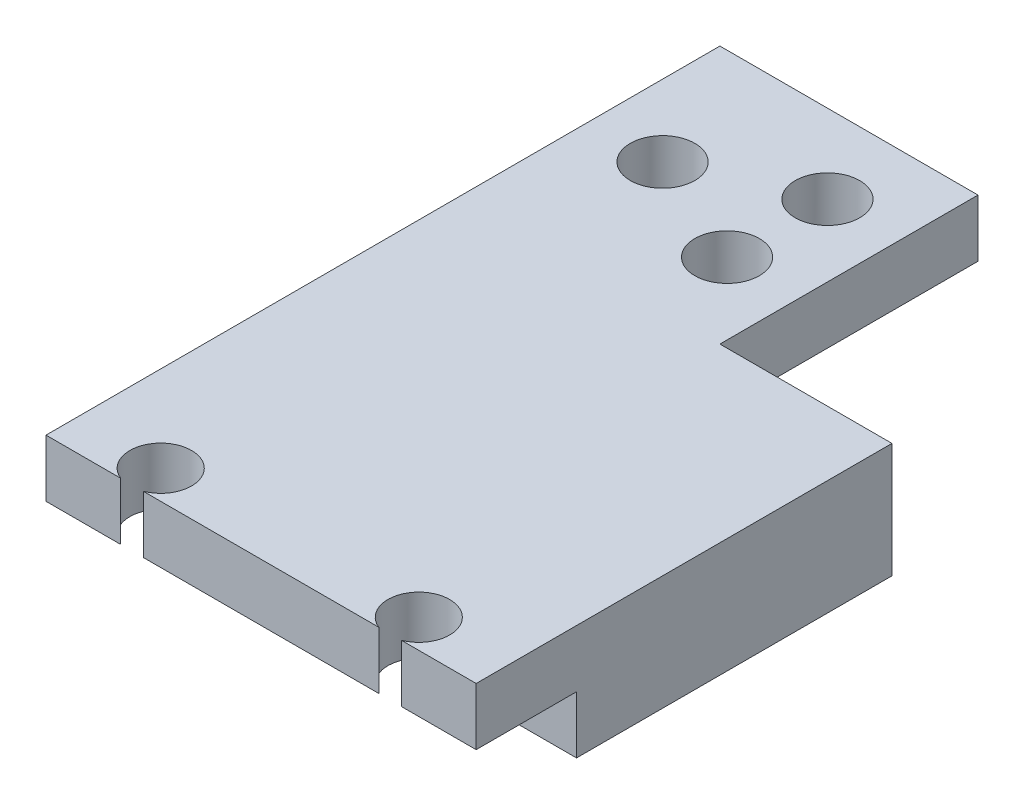
ISO-10303-21;
HEADER;
FILE_DESCRIPTION(('STEP AP214'),'2;1');
FILE_NAME('part.step','',(''),(''),'','','');
FILE_SCHEMA(('AUTOMOTIVE_DESIGN { 1 0 10303 214 1 1 1 1 }'));
ENDSEC;
DATA;
#1=APPLICATION_CONTEXT('core data for automotive mechanical design processes');
#2=APPLICATION_PROTOCOL_DEFINITION('international standard','automotive_design',2000,#1);
#3=PRODUCT_CONTEXT('',#1,'mechanical');
#4=PRODUCT('Part','Part','',(#3));
#5=PRODUCT_RELATED_PRODUCT_CATEGORY('part','',(#4));
#6=PRODUCT_DEFINITION_FORMATION('','',#4);
#7=PRODUCT_DEFINITION_CONTEXT('part definition',#1,'design');
#8=PRODUCT_DEFINITION('design','',#6,#7);
#9=PRODUCT_DEFINITION_SHAPE('','',#8);
#10=(LENGTH_UNIT() NAMED_UNIT(*) SI_UNIT(.MILLI.,.METRE.));
#11=(NAMED_UNIT(*) PLANE_ANGLE_UNIT() SI_UNIT($,.RADIAN.));
#12=(NAMED_UNIT(*) SI_UNIT($,.STERADIAN.) SOLID_ANGLE_UNIT());
#13=UNCERTAINTY_MEASURE_WITH_UNIT(LENGTH_MEASURE(1.E-05),#10,'distance_accuracy_value','');
#14=(GEOMETRIC_REPRESENTATION_CONTEXT(3) GLOBAL_UNCERTAINTY_ASSIGNED_CONTEXT((#13)) GLOBAL_UNIT_ASSIGNED_CONTEXT((#10,
#11,#12)) REPRESENTATION_CONTEXT('',''));
#15=CARTESIAN_POINT('',(0.,0.,0.));
#16=DIRECTION('',(0.,0.,1.));
#17=DIRECTION('',(1.,0.,0.));
#18=AXIS2_PLACEMENT_3D('',#15,#16,#17);
#19=CARTESIAN_POINT('',(15.,4.,14.5));
#20=DIRECTION('',(-1.,0.,0.));
#21=DIRECTION('',(0.,0.,1.));
#22=AXIS2_PLACEMENT_3D('',#19,#20,#21);
#23=PLANE('',#22);
#24=DIRECTION('',(0.,-1.,0.));
#25=VECTOR('',#24,1.);
#26=CARTESIAN_POINT('',(15.,4.,-14.5));
#27=LINE('',#26,#25);
#28=CARTESIAN_POINT('',(15.,4.,-14.5));
#29=VERTEX_POINT('',#28);
#30=CARTESIAN_POINT('',(15.,-4.,-14.5));
#31=VERTEX_POINT('',#30);
#32=EDGE_CURVE('E11',#29,#31,#27,.T.);
#33=ORIENTED_EDGE('',*,*,#32,.F.);
#34=DIRECTION('',(0.,0.,-1.));
#35=VECTOR('',#34,1.);
#36=CARTESIAN_POINT('',(15.,4.,14.5));
#37=LINE('',#36,#35);
#38=CARTESIAN_POINT('',(15.,4.,14.5));
#39=VERTEX_POINT('',#38);
#40=EDGE_CURVE('E178',#39,#29,#37,.T.);
#41=ORIENTED_EDGE('',*,*,#40,.F.);
#42=DIRECTION('',(0.,-1.,0.));
#43=VECTOR('',#42,1.);
#44=CARTESIAN_POINT('',(15.,4.,14.5));
#45=LINE('',#44,#43);
#46=CARTESIAN_POINT('',(15.,0.,14.5));
#47=VERTEX_POINT('',#46);
#48=EDGE_CURVE('E193',#39,#47,#45,.T.);
#49=ORIENTED_EDGE('',*,*,#48,.T.);
#50=DIRECTION('',(0.,0.,-1.));
#51=VECTOR('',#50,1.);
#52=CARTESIAN_POINT('',(15.,0.,14.5));
#53=LINE('',#52,#51);
#54=CARTESIAN_POINT('',(15.,0.,7.5));
#55=VERTEX_POINT('',#54);
#56=EDGE_CURVE('E177',#47,#55,#53,.T.);
#57=ORIENTED_EDGE('',*,*,#56,.T.);
#58=DIRECTION('',(0.,1.,0.));
#59=VECTOR('',#58,1.);
#60=CARTESIAN_POINT('',(15.,-4.,7.5));
#61=LINE('',#60,#59);
#62=CARTESIAN_POINT('',(15.,-4.,7.5));
#63=VERTEX_POINT('',#62);
#64=EDGE_CURVE('E174',#63,#55,#61,.T.);
#65=ORIENTED_EDGE('',*,*,#64,.F.);
#66=DIRECTION('',(0.,0.,1.));
#67=VECTOR('',#66,1.);
#68=CARTESIAN_POINT('',(15.,-4.,-14.5));
#69=LINE('',#68,#67);
#70=EDGE_CURVE('E159',#31,#63,#69,.T.);
#71=ORIENTED_EDGE('',*,*,#70,.F.);
#72=EDGE_LOOP('',(#33,#41,#49,#57,#65,#71));
#73=FACE_BOUND('',#72,.T.);
#74=ADVANCED_FACE('F33',(#73),#23,.F.);
#75=CARTESIAN_POINT('',(-9.,4.,12.5));
#76=DIRECTION('',(0.,1.,0.));
#77=DIRECTION('',(0.,0.,1.));
#78=AXIS2_PLACEMENT_3D('',#75,#76,#77);
#79=PLANE('',#78);
#80=CARTESIAN_POINT('',(-10.,4.,-23.5));
#81=DIRECTION('',(0.,1.,0.));
#82=DIRECTION('',(0.,0.,1.));
#83=AXIS2_PLACEMENT_3D('',#80,#81,#82);
#84=CIRCLE('',#83,2.25000000000001);
#85=CARTESIAN_POINT('',(-10.,4.,-21.25));
#86=VERTEX_POINT('',#85);
#87=EDGE_CURVE('E426',#86,#86,#84,.T.);
#88=ORIENTED_EDGE('',*,*,#87,.F.);
#89=EDGE_LOOP('',(#88));
#90=FACE_BOUND('',#89,.T.);
#91=CARTESIAN_POINT('',(-2.,4.,-20.));
#92=DIRECTION('',(0.,1.,0.));
#93=DIRECTION('',(0.,0.,1.));
#94=AXIS2_PLACEMENT_3D('',#91,#92,#93);
#95=CIRCLE('',#94,2.25);
#96=CARTESIAN_POINT('',(-2.,4.,-17.75));
#97=VERTEX_POINT('',#96);
#98=EDGE_CURVE('E436',#97,#97,#95,.T.);
#99=ORIENTED_EDGE('',*,*,#98,.F.);
#100=EDGE_LOOP('',(#99));
#101=FACE_BOUND('',#100,.T.);
#102=CARTESIAN_POINT('',(-2.,4.,-27.));
#103=DIRECTION('',(0.,1.,0.));
#104=DIRECTION('',(0.,0.,1.));
#105=AXIS2_PLACEMENT_3D('',#102,#103,#104);
#106=CIRCLE('',#105,2.25);
#107=CARTESIAN_POINT('',(-2.,4.,-24.75));
#108=VERTEX_POINT('',#107);
#109=EDGE_CURVE('E156',#108,#108,#106,.T.);
#110=ORIENTED_EDGE('',*,*,#109,.F.);
#111=EDGE_LOOP('',(#110));
#112=FACE_BOUND('',#111,.T.);
#113=DIRECTION('',(1.,0.,0.));
#114=VECTOR('',#113,1.);
#115=CARTESIAN_POINT('',(3.,4.,-14.5));
#116=LINE('',#115,#114);
#117=CARTESIAN_POINT('',(3.,4.,-14.5));
#118=VERTEX_POINT('',#117);
#119=EDGE_CURVE('E142',#118,#29,#116,.T.);
#120=ORIENTED_EDGE('',*,*,#119,.F.);
#121=DIRECTION('',(0.,0.,1.));
#122=VECTOR('',#121,1.);
#123=CARTESIAN_POINT('',(3.,4.,-32.5));
#124=LINE('',#123,#122);
#125=CARTESIAN_POINT('',(3.,4.,-32.5));
#126=VERTEX_POINT('',#125);
#127=EDGE_CURVE('E128',#126,#118,#124,.T.);
#128=ORIENTED_EDGE('',*,*,#127,.F.);
#129=DIRECTION('',(1.,0.,0.));
#130=VECTOR('',#129,1.);
#131=CARTESIAN_POINT('',(-15.,4.,-32.5));
#132=LINE('',#131,#130);
#133=CARTESIAN_POINT('',(-15.,4.,-32.5));
#134=VERTEX_POINT('',#133);
#135=EDGE_CURVE('E138',#134,#126,#132,.T.);
#136=ORIENTED_EDGE('',*,*,#135,.F.);
#137=DIRECTION('',(0.,0.,1.));
#138=VECTOR('',#137,1.);
#139=CARTESIAN_POINT('',(-15.,4.,14.5));
#140=LINE('',#139,#138);
#141=CARTESIAN_POINT('',(-15.,4.,14.5));
#142=VERTEX_POINT('',#141);
#143=EDGE_CURVE('E180',#134,#142,#140,.T.);
#144=ORIENTED_EDGE('',*,*,#143,.T.);
#145=DIRECTION('',(1.,0.,0.));
#146=VECTOR('',#145,1.);
#147=CARTESIAN_POINT('',(-15.,4.,14.5));
#148=LINE('',#147,#146);
#149=CARTESIAN_POINT('',(-9.78898669190298,4.,14.5));
#150=VERTEX_POINT('',#149);
#151=EDGE_CURVE('E183',#142,#150,#148,.T.);
#152=ORIENTED_EDGE('',*,*,#151,.T.);
#153=CARTESIAN_POINT('',(-9.,4.,12.5));
#154=DIRECTION('',(0.,-1.,0.));
#155=DIRECTION('',(0.,0.,1.));
#156=AXIS2_PLACEMENT_3D('',#153,#154,#155);
#157=CIRCLE('',#156,2.15);
#158=CARTESIAN_POINT('',(-8.21101330809702,4.,14.5));
#159=VERTEX_POINT('',#158);
#160=EDGE_CURVE('E185',#150,#159,#157,.T.);
#161=ORIENTED_EDGE('',*,*,#160,.T.);
#162=DIRECTION('',(1.,0.,0.));
#163=VECTOR('',#162,1.);
#164=CARTESIAN_POINT('',(-8.21101330809702,4.,14.5));
#165=LINE('',#164,#163);
#166=CARTESIAN_POINT('',(8.21101330809702,4.,14.5));
#167=VERTEX_POINT('',#166);
#168=EDGE_CURVE('E187',#159,#167,#165,.T.);
#169=ORIENTED_EDGE('',*,*,#168,.T.);
#170=CARTESIAN_POINT('',(9.,4.,12.5));
#171=DIRECTION('',(0.,-1.,0.));
#172=DIRECTION('',(0.,0.,-1.));
#173=AXIS2_PLACEMENT_3D('',#170,#171,#172);
#174=CIRCLE('',#173,2.15);
#175=CARTESIAN_POINT('',(9.78898669190297,4.,14.5));
#176=VERTEX_POINT('',#175);
#177=EDGE_CURVE('E189',#167,#176,#174,.T.);
#178=ORIENTED_EDGE('',*,*,#177,.T.);
#179=DIRECTION('',(1.,0.,0.));
#180=VECTOR('',#179,1.);
#181=CARTESIAN_POINT('',(9.78898669190298,4.,14.5));
#182=LINE('',#181,#180);
#183=EDGE_CURVE('E191',#176,#39,#182,.T.);
#184=ORIENTED_EDGE('',*,*,#183,.T.);
#185=ORIENTED_EDGE('',*,*,#40,.T.);
#186=EDGE_LOOP('',(#120,#128,#136,#144,#152,#161,#169,#178,#184,#185));
#187=FACE_BOUND('',#186,.T.);
#188=ADVANCED_FACE('F137',(#90,#101,#112,#187),#79,.T.);
#189=CARTESIAN_POINT('',(-15.,0.,-32.5));
#190=DIRECTION('',(0.,1.,0.));
#191=DIRECTION('',(-1.,0.,0.));
#192=AXIS2_PLACEMENT_3D('',#189,#190,#191);
#193=PLANE('',#192);
#194=CARTESIAN_POINT('',(-2.,0.,-27.));
#195=DIRECTION('',(0.,1.,0.));
#196=DIRECTION('',(-1.,0.,0.));
#197=AXIS2_PLACEMENT_3D('',#194,#195,#196);
#198=CIRCLE('',#197,2.25);
#199=CARTESIAN_POINT('',(-4.25,0.,-27.));
#200=VERTEX_POINT('',#199);
#201=EDGE_CURVE('E439',#200,#200,#198,.T.);
#202=ORIENTED_EDGE('',*,*,#201,.T.);
#203=EDGE_LOOP('',(#202));
#204=FACE_BOUND('',#203,.T.);
#205=CARTESIAN_POINT('',(-2.,0.,-20.));
#206=DIRECTION('',(0.,1.,0.));
#207=DIRECTION('',(1.,0.,0.));
#208=AXIS2_PLACEMENT_3D('',#205,#206,#207);
#209=CIRCLE('',#208,2.25);
#210=CARTESIAN_POINT('',(0.249999999999999,0.,-20.));
#211=VERTEX_POINT('',#210);
#212=EDGE_CURVE('E432',#211,#211,#209,.T.);
#213=ORIENTED_EDGE('',*,*,#212,.T.);
#214=EDGE_LOOP('',(#213));
#215=FACE_BOUND('',#214,.T.);
#216=CARTESIAN_POINT('',(-10.,0.,-23.5));
#217=DIRECTION('',(0.,1.,0.));
#218=DIRECTION('',(-1.,0.,0.));
#219=AXIS2_PLACEMENT_3D('',#216,#217,#218);
#220=CIRCLE('',#219,2.25000000000001);
#221=CARTESIAN_POINT('',(-12.25,0.,-23.5));
#222=VERTEX_POINT('',#221);
#223=EDGE_CURVE('E429',#222,#222,#220,.T.);
#224=ORIENTED_EDGE('',*,*,#223,.T.);
#225=EDGE_LOOP('',(#224));
#226=FACE_BOUND('',#225,.T.);
#227=DIRECTION('',(0.,0.,1.));
#228=VECTOR('',#227,1.);
#229=CARTESIAN_POINT('',(3.,0.,-32.5));
#230=LINE('',#229,#228);
#231=CARTESIAN_POINT('',(3.,0.,-32.5));
#232=VERTEX_POINT('',#231);
#233=CARTESIAN_POINT('',(3.,0.,-14.5));
#234=VERTEX_POINT('',#233);
#235=EDGE_CURVE('E47',#232,#234,#230,.T.);
#236=ORIENTED_EDGE('',*,*,#235,.T.);
#237=DIRECTION('',(-1.,0.,0.));
#238=VECTOR('',#237,1.);
#239=CARTESIAN_POINT('',(-15.,0.,-14.5));
#240=LINE('',#239,#238);
#241=CARTESIAN_POINT('',(-15.,0.,-14.5));
#242=VERTEX_POINT('',#241);
#243=EDGE_CURVE('E151',#234,#242,#240,.T.);
#244=ORIENTED_EDGE('',*,*,#243,.T.);
#245=DIRECTION('',(0.,0.,1.));
#246=VECTOR('',#245,1.);
#247=CARTESIAN_POINT('',(-15.,0.,-32.5));
#248=LINE('',#247,#246);
#249=CARTESIAN_POINT('',(-15.,0.,-32.5));
#250=VERTEX_POINT('',#249);
#251=EDGE_CURVE('E149',#250,#242,#248,.T.);
#252=ORIENTED_EDGE('',*,*,#251,.F.);
#253=DIRECTION('',(-1.,0.,0.));
#254=VECTOR('',#253,1.);
#255=CARTESIAN_POINT('',(-15.,0.,-32.5));
#256=LINE('',#255,#254);
#257=EDGE_CURVE('E147',#232,#250,#256,.T.);
#258=ORIENTED_EDGE('',*,*,#257,.F.);
#259=EDGE_LOOP('',(#236,#244,#252,#258));
#260=FACE_BOUND('',#259,.T.);
#261=ADVANCED_FACE('F280',(#204,#215,#226,#260),#193,.F.);
#262=CARTESIAN_POINT('',(0.,0.,-32.5));
#263=DIRECTION('',(0.,0.,-1.));
#264=DIRECTION('',(-1.,0.,0.));
#265=AXIS2_PLACEMENT_3D('',#262,#263,#264);
#266=PLANE('',#265);
#267=ORIENTED_EDGE('',*,*,#135,.T.);
#268=DIRECTION('',(0.,-1.,0.));
#269=VECTOR('',#268,1.);
#270=CARTESIAN_POINT('',(3.,4.001,-32.5));
#271=LINE('',#270,#269);
#272=EDGE_CURVE('E125',#126,#232,#271,.T.);
#273=ORIENTED_EDGE('',*,*,#272,.T.);
#274=ORIENTED_EDGE('',*,*,#257,.T.);
#275=DIRECTION('',(0.,1.,0.));
#276=VECTOR('',#275,1.);
#277=CARTESIAN_POINT('',(-15.,0.,-32.5));
#278=LINE('',#277,#276);
#279=EDGE_CURVE('E146',#250,#134,#278,.T.);
#280=ORIENTED_EDGE('',*,*,#279,.T.);
#281=EDGE_LOOP('',(#267,#273,#274,#280));
#282=FACE_BOUND('',#281,.T.);
#283=ADVANCED_FACE('F144',(#282),#266,.T.);
#284=CARTESIAN_POINT('',(-15.,4.,-14.5));
#285=DIRECTION('',(0.,0.,1.));
#286=DIRECTION('',(1.,0.,0.));
#287=AXIS2_PLACEMENT_3D('',#284,#285,#286);
#288=PLANE('',#287);
#289=ORIENTED_EDGE('',*,*,#243,.F.);
#290=DIRECTION('',(0.,-1.,0.));
#291=VECTOR('',#290,1.);
#292=CARTESIAN_POINT('',(3.,4.001,-14.5));
#293=LINE('',#292,#291);
#294=EDGE_CURVE('E133',#118,#234,#293,.T.);
#295=ORIENTED_EDGE('',*,*,#294,.F.);
#296=ORIENTED_EDGE('',*,*,#119,.T.);
#297=ORIENTED_EDGE('',*,*,#32,.T.);
#298=DIRECTION('',(1.,0.,0.));
#299=VECTOR('',#298,1.);
#300=CARTESIAN_POINT('',(15.,-4.,-14.5));
#301=LINE('',#300,#299);
#302=CARTESIAN_POINT('',(-15.,-4.,-14.5));
#303=VERTEX_POINT('',#302);
#304=EDGE_CURVE('E167',#303,#31,#301,.T.);
#305=ORIENTED_EDGE('',*,*,#304,.F.);
#306=DIRECTION('',(0.,-1.,0.));
#307=VECTOR('',#306,1.);
#308=CARTESIAN_POINT('',(-15.,4.,-14.5));
#309=LINE('',#308,#307);
#310=EDGE_CURVE('E40',#242,#303,#309,.T.);
#311=ORIENTED_EDGE('',*,*,#310,.F.);
#312=EDGE_LOOP('',(#289,#295,#296,#297,#305,#311));
#313=FACE_BOUND('',#312,.T.);
#314=ADVANCED_FACE('F234',(#313),#288,.F.);
#315=CARTESIAN_POINT('',(-9.,0.,12.5));
#316=DIRECTION('',(0.,1.,0.));
#317=DIRECTION('',(0.,0.,1.));
#318=AXIS2_PLACEMENT_3D('',#315,#316,#317);
#319=PLANE('',#318);
#320=DIRECTION('',(-1.,0.,0.));
#321=VECTOR('',#320,1.);
#322=CARTESIAN_POINT('',(15.,0.,7.5));
#323=LINE('',#322,#321);
#324=CARTESIAN_POINT('',(-15.,0.,7.5));
#325=VERTEX_POINT('',#324);
#326=EDGE_CURVE('E55',#55,#325,#323,.T.);
#327=ORIENTED_EDGE('',*,*,#326,.F.);
#328=ORIENTED_EDGE('',*,*,#56,.F.);
#329=DIRECTION('',(1.,0.,0.));
#330=VECTOR('',#329,1.);
#331=CARTESIAN_POINT('',(9.78898669190298,0.,14.5));
#332=LINE('',#331,#330);
#333=CARTESIAN_POINT('',(9.78898669190297,0.,14.5));
#334=VERTEX_POINT('',#333);
#335=EDGE_CURVE('E181',#334,#47,#332,.T.);
#336=ORIENTED_EDGE('',*,*,#335,.F.);
#337=CARTESIAN_POINT('',(9.,0.,12.5));
#338=DIRECTION('',(0.,-1.,0.));
#339=DIRECTION('',(0.,0.,-1.));
#340=AXIS2_PLACEMENT_3D('',#337,#338,#339);
#341=CIRCLE('',#340,2.15);
#342=CARTESIAN_POINT('',(8.21101330809702,0.,14.5));
#343=VERTEX_POINT('',#342);
#344=EDGE_CURVE('E203',#343,#334,#341,.T.);
#345=ORIENTED_EDGE('',*,*,#344,.F.);
#346=DIRECTION('',(1.,0.,0.));
#347=VECTOR('',#346,1.);
#348=CARTESIAN_POINT('',(-8.21101330809702,0.,14.5));
#349=LINE('',#348,#347);
#350=CARTESIAN_POINT('',(-8.21101330809702,0.,14.5));
#351=VERTEX_POINT('',#350);
#352=EDGE_CURVE('E201',#351,#343,#349,.T.);
#353=ORIENTED_EDGE('',*,*,#352,.F.);
#354=CARTESIAN_POINT('',(-9.,0.,12.5));
#355=DIRECTION('',(0.,-1.,0.));
#356=DIRECTION('',(0.,0.,1.));
#357=AXIS2_PLACEMENT_3D('',#354,#355,#356);
#358=CIRCLE('',#357,2.15);
#359=CARTESIAN_POINT('',(-9.78898669190298,0.,14.5));
#360=VERTEX_POINT('',#359);
#361=EDGE_CURVE('E199',#360,#351,#358,.T.);
#362=ORIENTED_EDGE('',*,*,#361,.F.);
#363=DIRECTION('',(1.,0.,0.));
#364=VECTOR('',#363,1.);
#365=CARTESIAN_POINT('',(-15.,0.,14.5));
#366=LINE('',#365,#364);
#367=CARTESIAN_POINT('',(-15.,0.,14.5));
#368=VERTEX_POINT('',#367);
#369=EDGE_CURVE('E197',#368,#360,#366,.T.);
#370=ORIENTED_EDGE('',*,*,#369,.F.);
#371=DIRECTION('',(0.,0.,1.));
#372=VECTOR('',#371,1.);
#373=CARTESIAN_POINT('',(-15.,0.,14.5));
#374=LINE('',#373,#372);
#375=EDGE_CURVE('E195',#325,#368,#374,.T.);
#376=ORIENTED_EDGE('',*,*,#375,.F.);
#377=EDGE_LOOP('',(#327,#328,#336,#345,#353,#362,#370,#376));
#378=FACE_BOUND('',#377,.T.);
#379=ADVANCED_FACE('F247',(#378),#319,.F.);
#380=CARTESIAN_POINT('',(-15.,4.,14.5));
#381=DIRECTION('',(1.,0.,0.));
#382=DIRECTION('',(0.,0.,-1.));
#383=AXIS2_PLACEMENT_3D('',#380,#381,#382);
#384=PLANE('',#383);
#385=ORIENTED_EDGE('',*,*,#143,.F.);
#386=ORIENTED_EDGE('',*,*,#279,.F.);
#387=ORIENTED_EDGE('',*,*,#251,.T.);
#388=ORIENTED_EDGE('',*,*,#310,.T.);
#389=DIRECTION('',(0.,0.,-1.));
#390=VECTOR('',#389,1.);
#391=CARTESIAN_POINT('',(-15.,-4.,-14.5));
#392=LINE('',#391,#390);
#393=CARTESIAN_POINT('',(-15.,-4.,7.5));
#394=VERTEX_POINT('',#393);
#395=EDGE_CURVE('E164',#394,#303,#392,.T.);
#396=ORIENTED_EDGE('',*,*,#395,.F.);
#397=DIRECTION('',(0.,1.,0.));
#398=VECTOR('',#397,1.);
#399=CARTESIAN_POINT('',(-15.,-4.,7.5));
#400=LINE('',#399,#398);
#401=EDGE_CURVE('E170',#394,#325,#400,.T.);
#402=ORIENTED_EDGE('',*,*,#401,.T.);
#403=ORIENTED_EDGE('',*,*,#375,.T.);
#404=DIRECTION('',(0.,-1.,0.));
#405=VECTOR('',#404,1.);
#406=CARTESIAN_POINT('',(-15.,4.,14.5));
#407=LINE('',#406,#405);
#408=EDGE_CURVE('E220',#142,#368,#407,.T.);
#409=ORIENTED_EDGE('',*,*,#408,.F.);
#410=EDGE_LOOP('',(#385,#386,#387,#388,#396,#402,#403,#409));
#411=FACE_BOUND('',#410,.T.);
#412=ADVANCED_FACE('F225',(#411),#384,.F.);
#413=CARTESIAN_POINT('',(-15.,4.,14.5));
#414=DIRECTION('',(0.,0.,-1.));
#415=DIRECTION('',(-1.,0.,0.));
#416=AXIS2_PLACEMENT_3D('',#413,#414,#415);
#417=PLANE('',#416);
#418=ORIENTED_EDGE('',*,*,#369,.T.);
#419=DIRECTION('',(0.,-1.,0.));
#420=VECTOR('',#419,1.);
#421=CARTESIAN_POINT('',(-9.78898669190298,4.,14.5));
#422=LINE('',#421,#420);
#423=EDGE_CURVE('E217',#150,#360,#422,.T.);
#424=ORIENTED_EDGE('',*,*,#423,.F.);
#425=ORIENTED_EDGE('',*,*,#151,.F.);
#426=ORIENTED_EDGE('',*,*,#408,.T.);
#427=EDGE_LOOP('',(#418,#424,#425,#426));
#428=FACE_BOUND('',#427,.T.);
#429=ADVANCED_FACE('F244',(#428),#417,.F.);
#430=CARTESIAN_POINT('',(-9.,4.,12.5));
#431=DIRECTION('',(0.,-1.,0.));
#432=DIRECTION('',(0.,0.,-1.));
#433=AXIS2_PLACEMENT_3D('',#430,#431,#432);
#434=CYLINDRICAL_SURFACE('',#433,2.15);
#435=ORIENTED_EDGE('',*,*,#361,.T.);
#436=DIRECTION('',(0.,-1.,0.));
#437=VECTOR('',#436,1.);
#438=CARTESIAN_POINT('',(-8.21101330809702,4.,14.5));
#439=LINE('',#438,#437);
#440=EDGE_CURVE('E214',#159,#351,#439,.T.);
#441=ORIENTED_EDGE('',*,*,#440,.F.);
#442=ORIENTED_EDGE('',*,*,#160,.F.);
#443=ORIENTED_EDGE('',*,*,#423,.T.);
#444=EDGE_LOOP('',(#435,#441,#442,#443));
#445=FACE_BOUND('',#444,.T.);
#446=ADVANCED_FACE('F252',(#445),#434,.F.);
#447=CARTESIAN_POINT('',(-8.21101330809702,4.,14.5));
#448=DIRECTION('',(0.,0.,-1.));
#449=DIRECTION('',(-1.,0.,0.));
#450=AXIS2_PLACEMENT_3D('',#447,#448,#449);
#451=PLANE('',#450);
#452=ORIENTED_EDGE('',*,*,#352,.T.);
#453=DIRECTION('',(0.,-1.,0.));
#454=VECTOR('',#453,1.);
#455=CARTESIAN_POINT('',(8.21101330809702,4.,14.5));
#456=LINE('',#455,#454);
#457=EDGE_CURVE('E211',#167,#343,#456,.T.);
#458=ORIENTED_EDGE('',*,*,#457,.F.);
#459=ORIENTED_EDGE('',*,*,#168,.F.);
#460=ORIENTED_EDGE('',*,*,#440,.T.);
#461=EDGE_LOOP('',(#452,#458,#459,#460));
#462=FACE_BOUND('',#461,.T.);
#463=ADVANCED_FACE('F256',(#462),#451,.F.);
#464=CARTESIAN_POINT('',(9.,4.,12.5));
#465=DIRECTION('',(0.,-1.,0.));
#466=DIRECTION('',(0.,0.,-1.));
#467=AXIS2_PLACEMENT_3D('',#464,#465,#466);
#468=CYLINDRICAL_SURFACE('',#467,2.15);
#469=ORIENTED_EDGE('',*,*,#344,.T.);
#470=DIRECTION('',(0.,-1.,0.));
#471=VECTOR('',#470,1.);
#472=CARTESIAN_POINT('',(9.78898669190297,4.,14.5));
#473=LINE('',#472,#471);
#474=EDGE_CURVE('E208',#176,#334,#473,.T.);
#475=ORIENTED_EDGE('',*,*,#474,.F.);
#476=ORIENTED_EDGE('',*,*,#177,.F.);
#477=ORIENTED_EDGE('',*,*,#457,.T.);
#478=EDGE_LOOP('',(#469,#475,#476,#477));
#479=FACE_BOUND('',#478,.T.);
#480=ADVANCED_FACE('F263',(#479),#468,.F.);
#481=CARTESIAN_POINT('',(9.78898669190298,4.,14.5));
#482=DIRECTION('',(0.,0.,-1.));
#483=DIRECTION('',(-1.,0.,0.));
#484=AXIS2_PLACEMENT_3D('',#481,#482,#483);
#485=PLANE('',#484);
#486=ORIENTED_EDGE('',*,*,#335,.T.);
#487=ORIENTED_EDGE('',*,*,#48,.F.);
#488=ORIENTED_EDGE('',*,*,#183,.F.);
#489=ORIENTED_EDGE('',*,*,#474,.T.);
#490=EDGE_LOOP('',(#486,#487,#488,#489));
#491=FACE_BOUND('',#490,.T.);
#492=ADVANCED_FACE('F266',(#491),#485,.F.);
#493=CARTESIAN_POINT('',(15.,-4.,7.5));
#494=DIRECTION('',(0.,0.,-1.));
#495=DIRECTION('',(-1.,0.,0.));
#496=AXIS2_PLACEMENT_3D('',#493,#494,#495);
#497=PLANE('',#496);
#498=ORIENTED_EDGE('',*,*,#326,.T.);
#499=ORIENTED_EDGE('',*,*,#401,.F.);
#500=DIRECTION('',(-1.,0.,0.));
#501=VECTOR('',#500,1.);
#502=CARTESIAN_POINT('',(15.,-4.,7.5));
#503=LINE('',#502,#501);
#504=EDGE_CURVE('E162',#63,#394,#503,.T.);
#505=ORIENTED_EDGE('',*,*,#504,.F.);
#506=ORIENTED_EDGE('',*,*,#64,.T.);
#507=EDGE_LOOP('',(#498,#499,#505,#506));
#508=FACE_BOUND('',#507,.T.);
#509=ADVANCED_FACE('F239',(#508),#497,.F.);
#510=CARTESIAN_POINT('',(0.,-4.,0.));
#511=DIRECTION('',(0.,-1.,0.));
#512=DIRECTION('',(0.,0.,-1.));
#513=AXIS2_PLACEMENT_3D('',#510,#511,#512);
#514=PLANE('',#513);
#515=ORIENTED_EDGE('',*,*,#70,.T.);
#516=ORIENTED_EDGE('',*,*,#504,.T.);
#517=ORIENTED_EDGE('',*,*,#395,.T.);
#518=ORIENTED_EDGE('',*,*,#304,.T.);
#519=EDGE_LOOP('',(#515,#516,#517,#518));
#520=FACE_BOUND('',#519,.T.);
#521=ADVANCED_FACE('F231',(#520),#514,.T.);
#522=CARTESIAN_POINT('',(-2.,4.001,-27.));
#523=DIRECTION('',(0.,-1.,0.));
#524=DIRECTION('',(1.,0.,0.));
#525=AXIS2_PLACEMENT_3D('',#522,#523,#524);
#526=CYLINDRICAL_SURFACE('',#525,2.25);
#527=ORIENTED_EDGE('',*,*,#109,.T.);
#528=EDGE_LOOP('',(#527));
#529=FACE_BOUND('',#528,.T.);
#530=ORIENTED_EDGE('',*,*,#201,.F.);
#531=EDGE_LOOP('',(#530));
#532=FACE_BOUND('',#531,.T.);
#533=ADVANCED_FACE('F339',(#529,#532),#526,.F.);
#534=CARTESIAN_POINT('',(-2.,4.001,-20.));
#535=DIRECTION('',(0.,-1.,0.));
#536=DIRECTION('',(1.,0.,0.));
#537=AXIS2_PLACEMENT_3D('',#534,#535,#536);
#538=CYLINDRICAL_SURFACE('',#537,2.25);
#539=ORIENTED_EDGE('',*,*,#98,.T.);
#540=EDGE_LOOP('',(#539));
#541=FACE_BOUND('',#540,.T.);
#542=ORIENTED_EDGE('',*,*,#212,.F.);
#543=EDGE_LOOP('',(#542));
#544=FACE_BOUND('',#543,.T.);
#545=ADVANCED_FACE('F355',(#541,#544),#538,.F.);
#546=CARTESIAN_POINT('',(-10.,4.001,-23.5));
#547=DIRECTION('',(0.,-1.,0.));
#548=DIRECTION('',(1.,0.,0.));
#549=AXIS2_PLACEMENT_3D('',#546,#547,#548);
#550=CYLINDRICAL_SURFACE('',#549,2.25000000000001);
#551=ORIENTED_EDGE('',*,*,#87,.T.);
#552=EDGE_LOOP('',(#551));
#553=FACE_BOUND('',#552,.T.);
#554=ORIENTED_EDGE('',*,*,#223,.F.);
#555=EDGE_LOOP('',(#554));
#556=FACE_BOUND('',#555,.T.);
#557=ADVANCED_FACE('F365',(#553,#556),#550,.F.);
#558=CARTESIAN_POINT('',(3.,4.001,-32.5));
#559=DIRECTION('',(1.,0.,0.));
#560=DIRECTION('',(0.,1.,0.));
#561=AXIS2_PLACEMENT_3D('',#558,#559,#560);
#562=PLANE('',#561);
#563=ORIENTED_EDGE('',*,*,#127,.T.);
#564=ORIENTED_EDGE('',*,*,#294,.T.);
#565=ORIENTED_EDGE('',*,*,#235,.F.);
#566=ORIENTED_EDGE('',*,*,#272,.F.);
#567=EDGE_LOOP('',(#563,#564,#565,#566));
#568=FACE_BOUND('',#567,.T.);
#569=ADVANCED_FACE('F127',(#568),#562,.T.);
#570=CLOSED_SHELL('',(#74,#188,#261,#283,#314,#379,#412,#429,#446,#463,#480,#492,#509,#521,#533,
#545,#557,#569));
#571=MANIFOLD_SOLID_BREP('B2',#570);
#572=ADVANCED_BREP_SHAPE_REPRESENTATION('',(#18,#571),#14);
#573=SHAPE_DEFINITION_REPRESENTATION(#9,#572);
ENDSEC;
END-ISO-10303-21;
